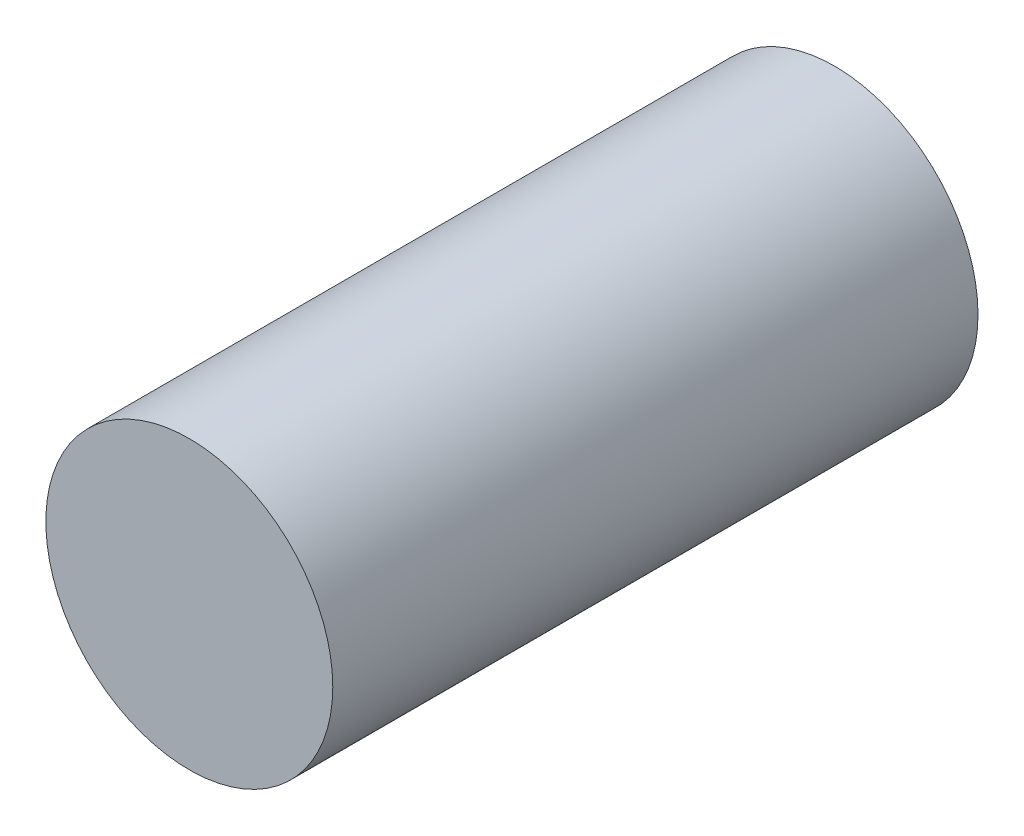
ISO-10303-21;
HEADER;
FILE_DESCRIPTION(('STEP AP214'),'2;1');
FILE_NAME('part.step','',(''),(''),'','','');
FILE_SCHEMA(('AUTOMOTIVE_DESIGN { 1 0 10303 214 1 1 1 1 }'));
ENDSEC;
DATA;
#1=APPLICATION_CONTEXT('core data for automotive mechanical design processes');
#2=APPLICATION_PROTOCOL_DEFINITION('international standard','automotive_design',2000,#1);
#3=PRODUCT_CONTEXT('',#1,'mechanical');
#4=PRODUCT('Part','Part','',(#3));
#5=PRODUCT_RELATED_PRODUCT_CATEGORY('part','',(#4));
#6=PRODUCT_DEFINITION_FORMATION('','',#4);
#7=PRODUCT_DEFINITION_CONTEXT('part definition',#1,'design');
#8=PRODUCT_DEFINITION('design','',#6,#7);
#9=PRODUCT_DEFINITION_SHAPE('','',#8);
#10=(LENGTH_UNIT() NAMED_UNIT(*) SI_UNIT(.MILLI.,.METRE.));
#11=(NAMED_UNIT(*) PLANE_ANGLE_UNIT() SI_UNIT($,.RADIAN.));
#12=(NAMED_UNIT(*) SI_UNIT($,.STERADIAN.) SOLID_ANGLE_UNIT());
#13=UNCERTAINTY_MEASURE_WITH_UNIT(LENGTH_MEASURE(1.E-05),#10,'distance_accuracy_value','');
#14=(GEOMETRIC_REPRESENTATION_CONTEXT(3) GLOBAL_UNCERTAINTY_ASSIGNED_CONTEXT((#13)) GLOBAL_UNIT_ASSIGNED_CONTEXT((#10,
#11,#12)) REPRESENTATION_CONTEXT('',''));
#15=CARTESIAN_POINT('',(0.,0.,0.));
#16=DIRECTION('',(0.,0.,1.));
#17=DIRECTION('',(1.,0.,0.));
#18=AXIS2_PLACEMENT_3D('',#15,#16,#17);
#19=CARTESIAN_POINT('',(0.,0.,5.));
#20=DIRECTION('',(0.,0.,-1.));
#21=DIRECTION('',(-1.,0.,0.));
#22=AXIS2_PLACEMENT_3D('',#19,#20,#21);
#23=CYLINDRICAL_SURFACE('',#22,58.7);
#24=CARTESIAN_POINT('',(0.,0.,0.));
#25=DIRECTION('',(0.,0.,1.));
#26=DIRECTION('',(1.,0.,0.));
#27=AXIS2_PLACEMENT_3D('',#24,#25,#26);
#28=CIRCLE('',#27,58.7);
#29=CARTESIAN_POINT('',(58.7,0.,0.));
#30=VERTEX_POINT('',#29);
#31=EDGE_CURVE('E48',#30,#30,#28,.T.);
#32=ORIENTED_EDGE('',*,*,#31,.T.);
#33=EDGE_LOOP('',(#32));
#34=FACE_BOUND('',#33,.T.);
#35=CARTESIAN_POINT('',(0.,0.,264.));
#36=DIRECTION('',(0.,0.,1.));
#37=DIRECTION('',(1.,0.,0.));
#38=AXIS2_PLACEMENT_3D('',#35,#36,#37);
#39=CIRCLE('',#38,58.7);
#40=CARTESIAN_POINT('',(58.7,0.,264.));
#41=VERTEX_POINT('',#40);
#42=EDGE_CURVE('E56',#41,#41,#39,.T.);
#43=ORIENTED_EDGE('',*,*,#42,.F.);
#44=EDGE_LOOP('',(#43));
#45=FACE_BOUND('',#44,.T.);
#46=ADVANCED_FACE('F41',(#34,#45),#23,.T.);
#47=CARTESIAN_POINT('',(0.,0.,0.));
#48=DIRECTION('',(0.,0.,1.));
#49=DIRECTION('',(1.,0.,0.));
#50=AXIS2_PLACEMENT_3D('',#47,#48,#49);
#51=PLANE('',#50);
#52=ORIENTED_EDGE('',*,*,#31,.F.);
#53=EDGE_LOOP('',(#52));
#54=FACE_BOUND('',#53,.T.);
#55=ADVANCED_FACE('F65',(#54),#51,.F.);
#56=CARTESIAN_POINT('',(0.,0.,264.));
#57=DIRECTION('',(0.,0.,1.));
#58=DIRECTION('',(1.,0.,0.));
#59=AXIS2_PLACEMENT_3D('',#56,#57,#58);
#60=PLANE('',#59);
#61=ORIENTED_EDGE('',*,*,#42,.T.);
#62=EDGE_LOOP('',(#61));
#63=FACE_BOUND('',#62,.T.);
#64=ADVANCED_FACE('F62',(#63),#60,.T.);
#65=CLOSED_SHELL('',(#46,#55,#64));
#66=CARTESIAN_POINT('',(0.,0.,5.));
#67=DIRECTION('',(0.,0.,1.));
#68=DIRECTION('',(1.,0.,0.));
#69=AXIS2_PLACEMENT_3D('',#66,#67,#68);
#70=PLANE('',#69);
#71=CARTESIAN_POINT('',(0.,0.,5.));
#72=DIRECTION('',(0.,0.,1.));
#73=DIRECTION('',(1.,0.,0.));
#74=AXIS2_PLACEMENT_3D('',#71,#72,#73);
#75=CIRCLE('',#74,48.7);
#76=CARTESIAN_POINT('',(48.7,0.,5.));
#77=VERTEX_POINT('',#76);
#78=EDGE_CURVE('E10',#77,#77,#75,.F.);
#79=ORIENTED_EDGE('',*,*,#78,.F.);
#80=EDGE_LOOP('',(#79));
#81=FACE_BOUND('',#80,.T.);
#82=ADVANCED_FACE('F75',(#81),#70,.T.);
#83=CARTESIAN_POINT('',(0.,0.,259.));
#84=DIRECTION('',(0.,0.,-1.));
#85=DIRECTION('',(-1.,0.,0.));
#86=AXIS2_PLACEMENT_3D('',#83,#84,#85);
#87=CYLINDRICAL_SURFACE('',#86,48.7);
#88=CARTESIAN_POINT('',(0.,0.,259.));
#89=DIRECTION('',(0.,0.,1.));
#90=DIRECTION('',(1.,0.,0.));
#91=AXIS2_PLACEMENT_3D('',#88,#89,#90);
#92=CIRCLE('',#91,48.7);
#93=CARTESIAN_POINT('',(48.7,0.,259.));
#94=VERTEX_POINT('',#93);
#95=EDGE_CURVE('E52',#94,#94,#92,.T.);
#96=ORIENTED_EDGE('',*,*,#95,.T.);
#97=EDGE_LOOP('',(#96));
#98=FACE_BOUND('',#97,.T.);
#99=ORIENTED_EDGE('',*,*,#78,.T.);
#100=EDGE_LOOP('',(#99));
#101=FACE_BOUND('',#100,.T.);
#102=ADVANCED_FACE('F78',(#98,#101),#87,.F.);
#103=CARTESIAN_POINT('',(0.,0.,259.));
#104=DIRECTION('',(0.,0.,1.));
#105=DIRECTION('',(1.,0.,0.));
#106=AXIS2_PLACEMENT_3D('',#103,#104,#105);
#107=PLANE('',#106);
#108=ORIENTED_EDGE('',*,*,#95,.F.);
#109=EDGE_LOOP('',(#108));
#110=FACE_BOUND('',#109,.T.);
#111=ADVANCED_FACE('F83',(#110),#107,.F.);
#112=CLOSED_SHELL('',(#82,#102,#111));
#113=ORIENTED_CLOSED_SHELL('',*,#112,.T.);
#114=BREP_WITH_VOIDS('B2',#65,(#113));
#115=ADVANCED_BREP_SHAPE_REPRESENTATION('',(#18,#114),#14);
#116=SHAPE_DEFINITION_REPRESENTATION(#9,#115);
ENDSEC;
END-ISO-10303-21;
